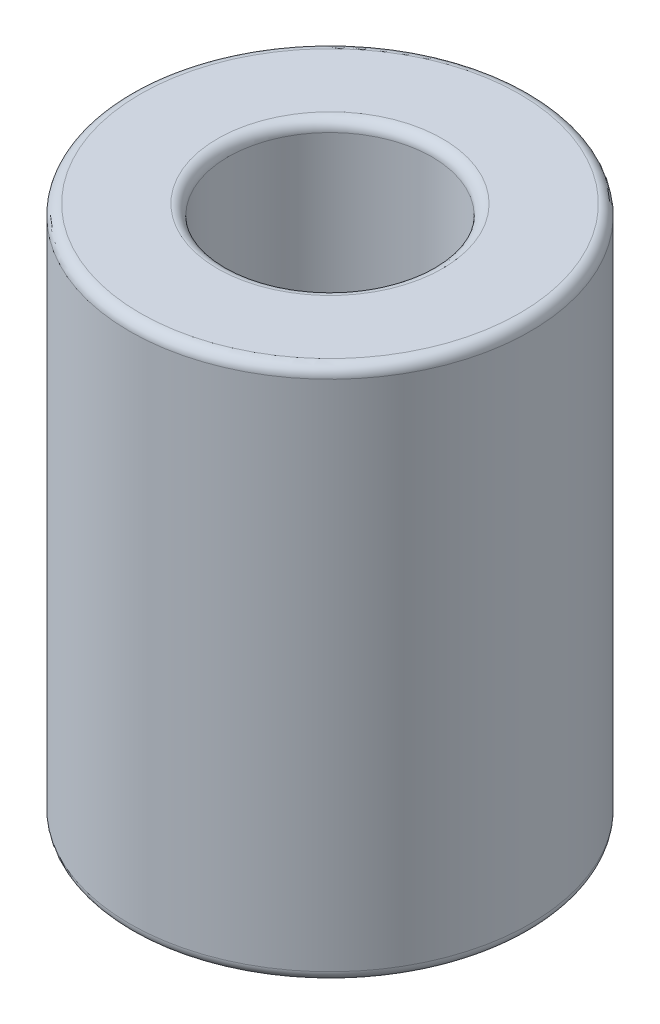
ISO-10303-21;
HEADER;
FILE_DESCRIPTION(('STEP AP214'),'2;1');
FILE_NAME('part.step','',(''),(''),'','','');
FILE_SCHEMA(('AUTOMOTIVE_DESIGN { 1 0 10303 214 1 1 1 1 }'));
ENDSEC;
DATA;
#1=APPLICATION_CONTEXT('core data for automotive mechanical design processes');
#2=APPLICATION_PROTOCOL_DEFINITION('international standard','automotive_design',2000,#1);
#3=PRODUCT_CONTEXT('',#1,'mechanical');
#4=PRODUCT('Part','Part','',(#3));
#5=PRODUCT_RELATED_PRODUCT_CATEGORY('part','',(#4));
#6=PRODUCT_DEFINITION_FORMATION('','',#4);
#7=PRODUCT_DEFINITION_CONTEXT('part definition',#1,'design');
#8=PRODUCT_DEFINITION('design','',#6,#7);
#9=PRODUCT_DEFINITION_SHAPE('','',#8);
#10=(LENGTH_UNIT() NAMED_UNIT(*) SI_UNIT(.MILLI.,.METRE.));
#11=(NAMED_UNIT(*) PLANE_ANGLE_UNIT() SI_UNIT($,.RADIAN.));
#12=(NAMED_UNIT(*) SI_UNIT($,.STERADIAN.) SOLID_ANGLE_UNIT());
#13=UNCERTAINTY_MEASURE_WITH_UNIT(LENGTH_MEASURE(1.E-05),#10,'distance_accuracy_value','');
#14=(GEOMETRIC_REPRESENTATION_CONTEXT(3) GLOBAL_UNCERTAINTY_ASSIGNED_CONTEXT((#13)) GLOBAL_UNIT_ASSIGNED_CONTEXT((#10,
#11,#12)) REPRESENTATION_CONTEXT('',''));
#15=CARTESIAN_POINT('',(0.,0.,0.));
#16=DIRECTION('',(0.,0.,1.));
#17=DIRECTION('',(1.,0.,0.));
#18=AXIS2_PLACEMENT_3D('',#15,#16,#17);
#19=CARTESIAN_POINT('',(0.,12.7,0.));
#20=DIRECTION('',(0.,1.,0.));
#21=DIRECTION('',(0.,0.,1.));
#22=AXIS2_PLACEMENT_3D('',#19,#20,#21);
#23=PLANE('',#22);
#24=CARTESIAN_POINT('',(0.,12.7,0.));
#25=DIRECTION('',(0.,1.,0.));
#26=DIRECTION('',(0.,0.,1.));
#27=AXIS2_PLACEMENT_3D('',#24,#25,#26);
#28=CIRCLE('',#27,5.3514);
#29=CARTESIAN_POINT('',(0.,12.7,5.3514));
#30=VERTEX_POINT('',#29);
#31=EDGE_CURVE('E10',#30,#30,#28,.F.);
#32=ORIENTED_EDGE('',*,*,#31,.T.);
#33=EDGE_LOOP('',(#32));
#34=FACE_BOUND('',#33,.T.);
#35=CARTESIAN_POINT('',(0.,12.7,0.));
#36=DIRECTION('',(0.,1.,0.));
#37=DIRECTION('',(0.,0.,1.));
#38=AXIS2_PLACEMENT_3D('',#35,#36,#37);
#39=CIRCLE('',#38,9.025);
#40=CARTESIAN_POINT('',(0.,12.7,9.025));
#41=VERTEX_POINT('',#40);
#42=EDGE_CURVE('E37',#41,#41,#39,.T.);
#43=ORIENTED_EDGE('',*,*,#42,.T.);
#44=EDGE_LOOP('',(#43));
#45=FACE_BOUND('',#44,.T.);
#46=ADVANCED_FACE('F30',(#34,#45),#23,.T.);
#47=CARTESIAN_POINT('',(0.,-12.7,0.));
#48=DIRECTION('',(0.,1.,0.));
#49=DIRECTION('',(0.,0.,1.));
#50=AXIS2_PLACEMENT_3D('',#47,#48,#49);
#51=PLANE('',#50);
#52=CARTESIAN_POINT('',(0.,-12.7,0.));
#53=DIRECTION('',(0.,1.,0.));
#54=DIRECTION('',(0.,0.,1.));
#55=AXIS2_PLACEMENT_3D('',#52,#53,#54);
#56=CIRCLE('',#55,5.3514);
#57=CARTESIAN_POINT('',(0.,-12.7,5.3514));
#58=VERTEX_POINT('',#57);
#59=EDGE_CURVE('E56',#58,#58,#56,.T.);
#60=ORIENTED_EDGE('',*,*,#59,.T.);
#61=EDGE_LOOP('',(#60));
#62=FACE_BOUND('',#61,.T.);
#63=CARTESIAN_POINT('',(0.,-12.7,0.));
#64=DIRECTION('',(0.,1.,0.));
#65=DIRECTION('',(0.,0.,1.));
#66=AXIS2_PLACEMENT_3D('',#63,#64,#65);
#67=CIRCLE('',#66,9.025);
#68=CARTESIAN_POINT('',(0.,-12.7,9.025));
#69=VERTEX_POINT('',#68);
#70=EDGE_CURVE('E59',#69,#69,#67,.F.);
#71=ORIENTED_EDGE('',*,*,#70,.T.);
#72=EDGE_LOOP('',(#71));
#73=FACE_BOUND('',#72,.T.);
#74=ADVANCED_FACE('F63',(#62,#73),#51,.F.);
#75=CARTESIAN_POINT('',(0.,12.7,0.));
#76=DIRECTION('',(0.,-1.,0.));
#77=DIRECTION('',(0.,0.,-1.));
#78=AXIS2_PLACEMENT_3D('',#75,#76,#77);
#79=CYLINDRICAL_SURFACE('',#78,9.525);
#80=CARTESIAN_POINT('',(0.,-12.2,0.));
#81=DIRECTION('',(0.,1.,0.));
#82=DIRECTION('',(0.,0.,1.));
#83=AXIS2_PLACEMENT_3D('',#80,#81,#82);
#84=CIRCLE('',#83,9.525);
#85=CARTESIAN_POINT('',(0.,-12.2,9.525));
#86=VERTEX_POINT('',#85);
#87=EDGE_CURVE('E41',#86,#86,#84,.T.);
#88=ORIENTED_EDGE('',*,*,#87,.T.);
#89=EDGE_LOOP('',(#88));
#90=FACE_BOUND('',#89,.T.);
#91=CARTESIAN_POINT('',(0.,12.2,0.));
#92=DIRECTION('',(0.,1.,0.));
#93=DIRECTION('',(0.,0.,1.));
#94=AXIS2_PLACEMENT_3D('',#91,#92,#93);
#95=CIRCLE('',#94,9.525);
#96=CARTESIAN_POINT('',(0.,12.2,9.525));
#97=VERTEX_POINT('',#96);
#98=EDGE_CURVE('E45',#97,#97,#95,.F.);
#99=ORIENTED_EDGE('',*,*,#98,.T.);
#100=EDGE_LOOP('',(#99));
#101=FACE_BOUND('',#100,.T.);
#102=ADVANCED_FACE('F73',(#90,#101),#79,.T.);
#103=CARTESIAN_POINT('',(0.,12.7,0.));
#104=DIRECTION('',(0.,-1.,0.));
#105=DIRECTION('',(0.,0.,-1.));
#106=AXIS2_PLACEMENT_3D('',#103,#104,#105);
#107=CYLINDRICAL_SURFACE('',#106,4.8514);
#108=CARTESIAN_POINT('',(0.,-12.2,0.));
#109=DIRECTION('',(0.,1.,0.));
#110=DIRECTION('',(0.,0.,1.));
#111=AXIS2_PLACEMENT_3D('',#108,#109,#110);
#112=CIRCLE('',#111,4.8514);
#113=CARTESIAN_POINT('',(0.,-12.2,4.8514));
#114=VERTEX_POINT('',#113);
#115=EDGE_CURVE('E50',#114,#114,#112,.F.);
#116=ORIENTED_EDGE('',*,*,#115,.T.);
#117=EDGE_LOOP('',(#116));
#118=FACE_BOUND('',#117,.T.);
#119=CARTESIAN_POINT('',(0.,12.2,0.));
#120=DIRECTION('',(0.,1.,0.));
#121=DIRECTION('',(0.,0.,1.));
#122=AXIS2_PLACEMENT_3D('',#119,#120,#121);
#123=CIRCLE('',#122,4.8514);
#124=CARTESIAN_POINT('',(0.,12.2,4.8514));
#125=VERTEX_POINT('',#124);
#126=EDGE_CURVE('E53',#125,#125,#123,.T.);
#127=ORIENTED_EDGE('',*,*,#126,.T.);
#128=EDGE_LOOP('',(#127));
#129=FACE_BOUND('',#128,.T.);
#130=ADVANCED_FACE('F76',(#118,#129),#107,.F.);
#131=CARTESIAN_POINT('',(0.,-12.2,0.));
#132=DIRECTION('',(0.,1.,0.));
#133=DIRECTION('',(0.,0.,1.));
#134=AXIS2_PLACEMENT_3D('',#131,#132,#133);
#135=TOROIDAL_SURFACE('',#134,5.3514,0.5);
#136=ORIENTED_EDGE('',*,*,#115,.F.);
#137=EDGE_LOOP('',(#136));
#138=FACE_BOUND('',#137,.T.);
#139=ORIENTED_EDGE('',*,*,#59,.F.);
#140=EDGE_LOOP('',(#139));
#141=FACE_BOUND('',#140,.T.);
#142=ADVANCED_FACE('F69',(#138,#141),#135,.T.);
#143=CARTESIAN_POINT('',(0.,-12.2,0.));
#144=DIRECTION('',(0.,1.,0.));
#145=DIRECTION('',(0.,0.,1.));
#146=AXIS2_PLACEMENT_3D('',#143,#144,#145);
#147=TOROIDAL_SURFACE('',#146,9.025,0.5);
#148=ORIENTED_EDGE('',*,*,#70,.F.);
#149=EDGE_LOOP('',(#148));
#150=FACE_BOUND('',#149,.T.);
#151=ORIENTED_EDGE('',*,*,#87,.F.);
#152=EDGE_LOOP('',(#151));
#153=FACE_BOUND('',#152,.T.);
#154=ADVANCED_FACE('F65',(#150,#153),#147,.T.);
#155=CARTESIAN_POINT('',(0.,12.2,0.));
#156=DIRECTION('',(0.,1.,0.));
#157=DIRECTION('',(0.,0.,1.));
#158=AXIS2_PLACEMENT_3D('',#155,#156,#157);
#159=TOROIDAL_SURFACE('',#158,5.3514,0.5);
#160=ORIENTED_EDGE('',*,*,#31,.F.);
#161=EDGE_LOOP('',(#160));
#162=FACE_BOUND('',#161,.T.);
#163=ORIENTED_EDGE('',*,*,#126,.F.);
#164=EDGE_LOOP('',(#163));
#165=FACE_BOUND('',#164,.T.);
#166=ADVANCED_FACE('F68',(#162,#165),#159,.T.);
#167=CARTESIAN_POINT('',(0.,12.2,0.));
#168=DIRECTION('',(0.,1.,0.));
#169=DIRECTION('',(0.,0.,1.));
#170=AXIS2_PLACEMENT_3D('',#167,#168,#169);
#171=TOROIDAL_SURFACE('',#170,9.025,0.5);
#172=ORIENTED_EDGE('',*,*,#98,.F.);
#173=EDGE_LOOP('',(#172));
#174=FACE_BOUND('',#173,.T.);
#175=ORIENTED_EDGE('',*,*,#42,.F.);
#176=EDGE_LOOP('',(#175));
#177=FACE_BOUND('',#176,.T.);
#178=ADVANCED_FACE('F32',(#174,#177),#171,.T.);
#179=CLOSED_SHELL('',(#46,#74,#102,#130,#142,#154,#166,#178));
#180=MANIFOLD_SOLID_BREP('B2',#179);
#181=ADVANCED_BREP_SHAPE_REPRESENTATION('',(#18,#180),#14);
#182=SHAPE_DEFINITION_REPRESENTATION(#9,#181);
ENDSEC;
END-ISO-10303-21;
